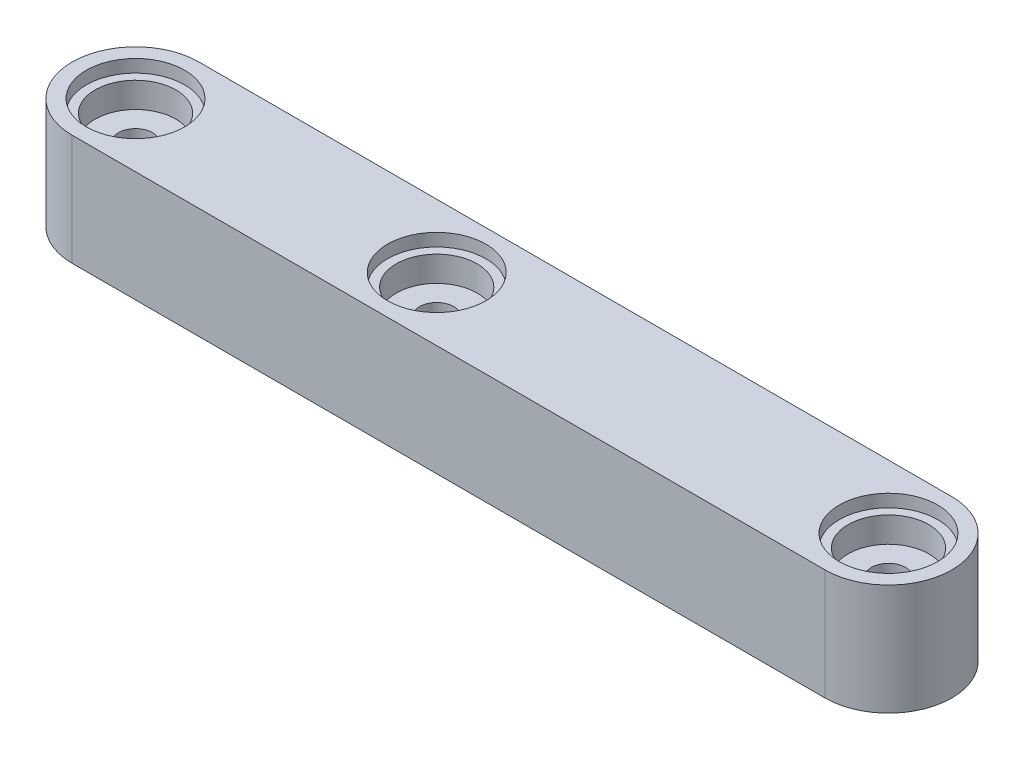
ISO-10303-21;
HEADER;
FILE_DESCRIPTION(('STEP AP214'),'2;1');
FILE_NAME('part.step','',(''),(''),'','','');
FILE_SCHEMA(('AUTOMOTIVE_DESIGN { 1 0 10303 214 1 1 1 1 }'));
ENDSEC;
DATA;
#1=APPLICATION_CONTEXT('core data for automotive mechanical design processes');
#2=APPLICATION_PROTOCOL_DEFINITION('international standard','automotive_design',2000,#1);
#3=PRODUCT_CONTEXT('',#1,'mechanical');
#4=PRODUCT('Part','Part','',(#3));
#5=PRODUCT_RELATED_PRODUCT_CATEGORY('part','',(#4));
#6=PRODUCT_DEFINITION_FORMATION('','',#4);
#7=PRODUCT_DEFINITION_CONTEXT('part definition',#1,'design');
#8=PRODUCT_DEFINITION('design','',#6,#7);
#9=PRODUCT_DEFINITION_SHAPE('','',#8);
#10=(LENGTH_UNIT() NAMED_UNIT(*) SI_UNIT(.MILLI.,.METRE.));
#11=(NAMED_UNIT(*) PLANE_ANGLE_UNIT() SI_UNIT($,.RADIAN.));
#12=(NAMED_UNIT(*) SI_UNIT($,.STERADIAN.) SOLID_ANGLE_UNIT());
#13=UNCERTAINTY_MEASURE_WITH_UNIT(LENGTH_MEASURE(1.E-05),#10,'distance_accuracy_value','');
#14=(GEOMETRIC_REPRESENTATION_CONTEXT(3) GLOBAL_UNCERTAINTY_ASSIGNED_CONTEXT((#13)) GLOBAL_UNIT_ASSIGNED_CONTEXT((#10,
#11,#12)) REPRESENTATION_CONTEXT('',''));
#15=CARTESIAN_POINT('',(0.,0.,0.));
#16=DIRECTION('',(0.,0.,1.));
#17=DIRECTION('',(1.,0.,0.));
#18=AXIS2_PLACEMENT_3D('',#15,#16,#17);
#19=CARTESIAN_POINT('',(47.5,4.6,4.));
#20=DIRECTION('',(0.,1.,0.));
#21=DIRECTION('',(0.,0.,1.));
#22=AXIS2_PLACEMENT_3D('',#19,#20,#21);
#23=CYLINDRICAL_SURFACE('',#22,2.55);
#24=CARTESIAN_POINT('',(47.5,4.6,4.));
#25=DIRECTION('',(0.,1.,0.));
#26=DIRECTION('',(0.,0.,1.));
#27=AXIS2_PLACEMENT_3D('',#24,#25,#26);
#28=CIRCLE('',#27,2.55);
#29=CARTESIAN_POINT('',(47.5,4.6,6.55));
#30=VERTEX_POINT('',#29);
#31=EDGE_CURVE('E134',#30,#30,#28,.T.);
#32=ORIENTED_EDGE('',*,*,#31,.F.);
#33=EDGE_LOOP('',(#32));
#34=FACE_BOUND('',#33,.T.);
#35=CARTESIAN_POINT('',(47.5,6.2,4.));
#36=DIRECTION('',(0.,1.,0.));
#37=DIRECTION('',(0.,0.,1.));
#38=AXIS2_PLACEMENT_3D('',#35,#36,#37);
#39=CIRCLE('',#38,2.55);
#40=CARTESIAN_POINT('',(47.5,6.2,6.55));
#41=VERTEX_POINT('',#40);
#42=EDGE_CURVE('E39',#41,#41,#39,.F.);
#43=ORIENTED_EDGE('',*,*,#42,.F.);
#44=EDGE_LOOP('',(#43));
#45=FACE_BOUND('',#44,.T.);
#46=ADVANCED_FACE('F35',(#34,#45),#23,.F.);
#47=CARTESIAN_POINT('',(19.,4.6,4.));
#48=DIRECTION('',(0.,1.,0.));
#49=DIRECTION('',(0.,0.,1.));
#50=AXIS2_PLACEMENT_3D('',#47,#48,#49);
#51=CYLINDRICAL_SURFACE('',#50,2.55);
#52=CARTESIAN_POINT('',(19.,4.6,4.));
#53=DIRECTION('',(0.,1.,0.));
#54=DIRECTION('',(0.,0.,1.));
#55=AXIS2_PLACEMENT_3D('',#52,#53,#54);
#56=CIRCLE('',#55,2.55);
#57=CARTESIAN_POINT('',(19.,4.6,6.55));
#58=VERTEX_POINT('',#57);
#59=EDGE_CURVE('E130',#58,#58,#56,.T.);
#60=ORIENTED_EDGE('',*,*,#59,.F.);
#61=EDGE_LOOP('',(#60));
#62=FACE_BOUND('',#61,.T.);
#63=CARTESIAN_POINT('',(19.,6.2,4.));
#64=DIRECTION('',(0.,1.,0.));
#65=DIRECTION('',(0.,0.,1.));
#66=AXIS2_PLACEMENT_3D('',#63,#64,#65);
#67=CIRCLE('',#66,2.55);
#68=CARTESIAN_POINT('',(19.,6.2,6.55));
#69=VERTEX_POINT('',#68);
#70=EDGE_CURVE('E124',#69,#69,#67,.F.);
#71=ORIENTED_EDGE('',*,*,#70,.F.);
#72=EDGE_LOOP('',(#71));
#73=FACE_BOUND('',#72,.T.);
#74=ADVANCED_FACE('F219',(#62,#73),#51,.F.);
#75=CARTESIAN_POINT('',(0.,4.6,4.));
#76=DIRECTION('',(0.,1.,0.));
#77=DIRECTION('',(0.,0.,1.));
#78=AXIS2_PLACEMENT_3D('',#75,#76,#77);
#79=CYLINDRICAL_SURFACE('',#78,2.55);
#80=CARTESIAN_POINT('',(0.,4.6,4.));
#81=DIRECTION('',(0.,1.,0.));
#82=DIRECTION('',(0.,0.,1.));
#83=AXIS2_PLACEMENT_3D('',#80,#81,#82);
#84=CIRCLE('',#83,2.55);
#85=CARTESIAN_POINT('',(0.,4.6,6.55));
#86=VERTEX_POINT('',#85);
#87=EDGE_CURVE('E115',#86,#86,#84,.T.);
#88=ORIENTED_EDGE('',*,*,#87,.F.);
#89=EDGE_LOOP('',(#88));
#90=FACE_BOUND('',#89,.T.);
#91=CARTESIAN_POINT('',(0.,6.2,4.));
#92=DIRECTION('',(0.,1.,0.));
#93=DIRECTION('',(0.,0.,1.));
#94=AXIS2_PLACEMENT_3D('',#91,#92,#93);
#95=CIRCLE('',#94,2.55);
#96=CARTESIAN_POINT('',(0.,6.2,6.55));
#97=VERTEX_POINT('',#96);
#98=EDGE_CURVE('E122',#97,#97,#95,.F.);
#99=ORIENTED_EDGE('',*,*,#98,.F.);
#100=EDGE_LOOP('',(#99));
#101=FACE_BOUND('',#100,.T.);
#102=ADVANCED_FACE('F157',(#90,#101),#79,.F.);
#103=CARTESIAN_POINT('',(0.,7.,4.));
#104=DIRECTION('',(0.,-1.,0.));
#105=DIRECTION('',(0.,0.,-1.));
#106=AXIS2_PLACEMENT_3D('',#103,#104,#105);
#107=CYLINDRICAL_SURFACE('',#106,1.075);
#108=CARTESIAN_POINT('',(0.,0.,4.));
#109=DIRECTION('',(0.,1.,0.));
#110=DIRECTION('',(0.,0.,1.));
#111=AXIS2_PLACEMENT_3D('',#108,#109,#110);
#112=CIRCLE('',#111,1.075);
#113=CARTESIAN_POINT('',(0.,0.,5.075));
#114=VERTEX_POINT('',#113);
#115=EDGE_CURVE('E105',#114,#114,#112,.T.);
#116=ORIENTED_EDGE('',*,*,#115,.F.);
#117=EDGE_LOOP('',(#116));
#118=FACE_BOUND('',#117,.T.);
#119=CARTESIAN_POINT('',(0.,4.6,4.));
#120=DIRECTION('',(0.,1.,0.));
#121=DIRECTION('',(0.,0.,1.));
#122=AXIS2_PLACEMENT_3D('',#119,#120,#121);
#123=CIRCLE('',#122,1.075);
#124=CARTESIAN_POINT('',(0.,4.6,5.075));
#125=VERTEX_POINT('',#124);
#126=EDGE_CURVE('E118',#125,#125,#123,.T.);
#127=ORIENTED_EDGE('',*,*,#126,.T.);
#128=EDGE_LOOP('',(#127));
#129=FACE_BOUND('',#128,.T.);
#130=ADVANCED_FACE('F153',(#118,#129),#107,.F.);
#131=CARTESIAN_POINT('',(19.,7.,4.));
#132=DIRECTION('',(0.,-1.,0.));
#133=DIRECTION('',(0.,0.,-1.));
#134=AXIS2_PLACEMENT_3D('',#131,#132,#133);
#135=CYLINDRICAL_SURFACE('',#134,1.075);
#136=CARTESIAN_POINT('',(19.,0.,4.));
#137=DIRECTION('',(0.,1.,0.));
#138=DIRECTION('',(0.,0.,1.));
#139=AXIS2_PLACEMENT_3D('',#136,#137,#138);
#140=CIRCLE('',#139,1.075);
#141=CARTESIAN_POINT('',(19.,0.,5.075));
#142=VERTEX_POINT('',#141);
#143=EDGE_CURVE('E144',#142,#142,#140,.T.);
#144=ORIENTED_EDGE('',*,*,#143,.F.);
#145=EDGE_LOOP('',(#144));
#146=FACE_BOUND('',#145,.T.);
#147=CARTESIAN_POINT('',(19.,4.6,4.));
#148=DIRECTION('',(0.,1.,0.));
#149=DIRECTION('',(0.,0.,1.));
#150=AXIS2_PLACEMENT_3D('',#147,#148,#149);
#151=CIRCLE('',#150,1.075);
#152=CARTESIAN_POINT('',(19.,4.6,5.075));
#153=VERTEX_POINT('',#152);
#154=EDGE_CURVE('E114',#153,#153,#151,.T.);
#155=ORIENTED_EDGE('',*,*,#154,.T.);
#156=EDGE_LOOP('',(#155));
#157=FACE_BOUND('',#156,.T.);
#158=ADVANCED_FACE('F156',(#146,#157),#135,.F.);
#159=CARTESIAN_POINT('',(47.5,7.,4.));
#160=DIRECTION('',(0.,-1.,0.));
#161=DIRECTION('',(0.,0.,-1.));
#162=AXIS2_PLACEMENT_3D('',#159,#160,#161);
#163=CYLINDRICAL_SURFACE('',#162,1.075);
#164=CARTESIAN_POINT('',(47.5,0.,4.));
#165=DIRECTION('',(0.,1.,0.));
#166=DIRECTION('',(0.,0.,1.));
#167=AXIS2_PLACEMENT_3D('',#164,#165,#166);
#168=CIRCLE('',#167,1.075);
#169=CARTESIAN_POINT('',(47.5,0.,5.075));
#170=VERTEX_POINT('',#169);
#171=EDGE_CURVE('E121',#170,#170,#168,.T.);
#172=ORIENTED_EDGE('',*,*,#171,.F.);
#173=EDGE_LOOP('',(#172));
#174=FACE_BOUND('',#173,.T.);
#175=CARTESIAN_POINT('',(47.5,4.6,4.));
#176=DIRECTION('',(0.,1.,0.));
#177=DIRECTION('',(0.,0.,1.));
#178=AXIS2_PLACEMENT_3D('',#175,#176,#177);
#179=CIRCLE('',#178,1.075);
#180=CARTESIAN_POINT('',(47.5,4.6,5.075));
#181=VERTEX_POINT('',#180);
#182=EDGE_CURVE('E111',#181,#181,#179,.T.);
#183=ORIENTED_EDGE('',*,*,#182,.T.);
#184=EDGE_LOOP('',(#183));
#185=FACE_BOUND('',#184,.T.);
#186=ADVANCED_FACE('F200',(#174,#185),#163,.F.);
#187=CARTESIAN_POINT('',(0.,7.,4.));
#188=DIRECTION('',(0.,1.,0.));
#189=DIRECTION('',(0.,0.,1.));
#190=AXIS2_PLACEMENT_3D('',#187,#188,#189);
#191=PLANE('',#190);
#192=CARTESIAN_POINT('',(0.,7.,4.));
#193=DIRECTION('',(0.,1.,0.));
#194=DIRECTION('',(0.,0.,1.));
#195=AXIS2_PLACEMENT_3D('',#192,#193,#194);
#196=CIRCLE('',#195,3.1);
#197=CARTESIAN_POINT('',(0.,7.,7.1));
#198=VERTEX_POINT('',#197);
#199=EDGE_CURVE('E183',#198,#198,#196,.T.);
#200=ORIENTED_EDGE('',*,*,#199,.F.);
#201=EDGE_LOOP('',(#200));
#202=FACE_BOUND('',#201,.T.);
#203=CARTESIAN_POINT('',(19.,7.,4.));
#204=DIRECTION('',(0.,1.,0.));
#205=DIRECTION('',(0.,0.,1.));
#206=AXIS2_PLACEMENT_3D('',#203,#204,#205);
#207=CIRCLE('',#206,3.1);
#208=CARTESIAN_POINT('',(19.,7.,7.1));
#209=VERTEX_POINT('',#208);
#210=EDGE_CURVE('E177',#209,#209,#207,.T.);
#211=ORIENTED_EDGE('',*,*,#210,.F.);
#212=EDGE_LOOP('',(#211));
#213=FACE_BOUND('',#212,.T.);
#214=CARTESIAN_POINT('',(47.5,7.,4.));
#215=DIRECTION('',(0.,1.,0.));
#216=DIRECTION('',(0.,0.,1.));
#217=AXIS2_PLACEMENT_3D('',#214,#215,#216);
#218=CIRCLE('',#217,3.1);
#219=CARTESIAN_POINT('',(47.5,7.,7.1));
#220=VERTEX_POINT('',#219);
#221=EDGE_CURVE('E171',#220,#220,#218,.T.);
#222=ORIENTED_EDGE('',*,*,#221,.F.);
#223=EDGE_LOOP('',(#222));
#224=FACE_BOUND('',#223,.T.);
#225=CARTESIAN_POINT('',(0.,7.,4.));
#226=DIRECTION('',(0.,1.,0.));
#227=DIRECTION('',(0.,0.,1.));
#228=AXIS2_PLACEMENT_3D('',#225,#226,#227);
#229=CIRCLE('',#228,4.);
#230=CARTESIAN_POINT('',(0.,7.,0.));
#231=VERTEX_POINT('',#230);
#232=CARTESIAN_POINT('',(0.,7.,8.));
#233=VERTEX_POINT('',#232);
#234=EDGE_CURVE('E89',#231,#233,#229,.T.);
#235=ORIENTED_EDGE('',*,*,#234,.T.);
#236=DIRECTION('',(1.,0.,0.));
#237=VECTOR('',#236,1.);
#238=CARTESIAN_POINT('',(0.,7.,8.));
#239=LINE('',#238,#237);
#240=CARTESIAN_POINT('',(47.5,7.,8.));
#241=VERTEX_POINT('',#240);
#242=EDGE_CURVE('E84',#233,#241,#239,.T.);
#243=ORIENTED_EDGE('',*,*,#242,.T.);
#244=CARTESIAN_POINT('',(47.5,7.,4.));
#245=DIRECTION('',(0.,1.,0.));
#246=DIRECTION('',(0.,0.,1.));
#247=AXIS2_PLACEMENT_3D('',#244,#245,#246);
#248=CIRCLE('',#247,4.);
#249=CARTESIAN_POINT('',(47.5,7.,0.));
#250=VERTEX_POINT('',#249);
#251=EDGE_CURVE('E87',#241,#250,#248,.T.);
#252=ORIENTED_EDGE('',*,*,#251,.T.);
#253=DIRECTION('',(-1.,0.,0.));
#254=VECTOR('',#253,1.);
#255=CARTESIAN_POINT('',(0.,7.,0.));
#256=LINE('',#255,#254);
#257=EDGE_CURVE('E54',#250,#231,#256,.T.);
#258=ORIENTED_EDGE('',*,*,#257,.T.);
#259=EDGE_LOOP('',(#235,#243,#252,#258));
#260=FACE_BOUND('',#259,.T.);
#261=ADVANCED_FACE('F85',(#202,#213,#224,#260),#191,.T.);
#262=CARTESIAN_POINT('',(0.,0.,4.));
#263=DIRECTION('',(0.,1.,0.));
#264=DIRECTION('',(0.,0.,1.));
#265=AXIS2_PLACEMENT_3D('',#262,#263,#264);
#266=PLANE('',#265);
#267=CARTESIAN_POINT('',(0.,0.,4.));
#268=DIRECTION('',(0.,1.,0.));
#269=DIRECTION('',(0.,0.,1.));
#270=AXIS2_PLACEMENT_3D('',#267,#268,#269);
#271=CIRCLE('',#270,4.);
#272=CARTESIAN_POINT('',(0.,0.,0.));
#273=VERTEX_POINT('',#272);
#274=CARTESIAN_POINT('',(0.,0.,8.));
#275=VERTEX_POINT('',#274);
#276=EDGE_CURVE('E102',#273,#275,#271,.T.);
#277=ORIENTED_EDGE('',*,*,#276,.F.);
#278=DIRECTION('',(-1.,0.,0.));
#279=VECTOR('',#278,1.);
#280=CARTESIAN_POINT('',(0.,0.,0.));
#281=LINE('',#280,#279);
#282=CARTESIAN_POINT('',(47.5,0.,0.));
#283=VERTEX_POINT('',#282);
#284=EDGE_CURVE('E77',#283,#273,#281,.T.);
#285=ORIENTED_EDGE('',*,*,#284,.F.);
#286=CARTESIAN_POINT('',(47.5,0.,4.));
#287=DIRECTION('',(0.,1.,0.));
#288=DIRECTION('',(0.,0.,1.));
#289=AXIS2_PLACEMENT_3D('',#286,#287,#288);
#290=CIRCLE('',#289,4.);
#291=CARTESIAN_POINT('',(47.5,0.,8.));
#292=VERTEX_POINT('',#291);
#293=EDGE_CURVE('E71',#292,#283,#290,.T.);
#294=ORIENTED_EDGE('',*,*,#293,.F.);
#295=DIRECTION('',(1.,0.,0.));
#296=VECTOR('',#295,1.);
#297=CARTESIAN_POINT('',(0.,0.,8.));
#298=LINE('',#297,#296);
#299=EDGE_CURVE('E93',#275,#292,#298,.T.);
#300=ORIENTED_EDGE('',*,*,#299,.F.);
#301=EDGE_LOOP('',(#277,#285,#294,#300));
#302=FACE_BOUND('',#301,.T.);
#303=ORIENTED_EDGE('',*,*,#115,.T.);
#304=EDGE_LOOP('',(#303));
#305=FACE_BOUND('',#304,.T.);
#306=ORIENTED_EDGE('',*,*,#143,.T.);
#307=EDGE_LOOP('',(#306));
#308=FACE_BOUND('',#307,.T.);
#309=ORIENTED_EDGE('',*,*,#171,.T.);
#310=EDGE_LOOP('',(#309));
#311=FACE_BOUND('',#310,.T.);
#312=ADVANCED_FACE('F150',(#302,#305,#308,#311),#266,.F.);
#313=CARTESIAN_POINT('',(0.,7.,4.));
#314=DIRECTION('',(0.,-1.,0.));
#315=DIRECTION('',(0.,0.,-1.));
#316=AXIS2_PLACEMENT_3D('',#313,#314,#315);
#317=CYLINDRICAL_SURFACE('',#316,4.);
#318=ORIENTED_EDGE('',*,*,#276,.T.);
#319=DIRECTION('',(0.,-1.,0.));
#320=VECTOR('',#319,1.);
#321=CARTESIAN_POINT('',(0.,7.,8.));
#322=LINE('',#321,#320);
#323=EDGE_CURVE('E11',#233,#275,#322,.T.);
#324=ORIENTED_EDGE('',*,*,#323,.F.);
#325=ORIENTED_EDGE('',*,*,#234,.F.);
#326=DIRECTION('',(0.,-1.,0.));
#327=VECTOR('',#326,1.);
#328=CARTESIAN_POINT('',(0.,7.,0.));
#329=LINE('',#328,#327);
#330=EDGE_CURVE('E98',#231,#273,#329,.T.);
#331=ORIENTED_EDGE('',*,*,#330,.T.);
#332=EDGE_LOOP('',(#318,#324,#325,#331));
#333=FACE_BOUND('',#332,.T.);
#334=ADVANCED_FACE('F37',(#333),#317,.T.);
#335=CARTESIAN_POINT('',(0.,7.,8.));
#336=DIRECTION('',(0.,0.,-1.));
#337=DIRECTION('',(-1.,0.,0.));
#338=AXIS2_PLACEMENT_3D('',#335,#336,#337);
#339=PLANE('',#338);
#340=ORIENTED_EDGE('',*,*,#299,.T.);
#341=DIRECTION('',(0.,-1.,0.));
#342=VECTOR('',#341,1.);
#343=CARTESIAN_POINT('',(47.5,7.,8.));
#344=LINE('',#343,#342);
#345=EDGE_CURVE('E45',#241,#292,#344,.T.);
#346=ORIENTED_EDGE('',*,*,#345,.F.);
#347=ORIENTED_EDGE('',*,*,#242,.F.);
#348=ORIENTED_EDGE('',*,*,#323,.T.);
#349=EDGE_LOOP('',(#340,#346,#347,#348));
#350=FACE_BOUND('',#349,.T.);
#351=ADVANCED_FACE('F92',(#350),#339,.F.);
#352=CARTESIAN_POINT('',(47.5,7.,4.));
#353=DIRECTION('',(0.,-1.,0.));
#354=DIRECTION('',(0.,0.,-1.));
#355=AXIS2_PLACEMENT_3D('',#352,#353,#354);
#356=CYLINDRICAL_SURFACE('',#355,4.);
#357=ORIENTED_EDGE('',*,*,#293,.T.);
#358=DIRECTION('',(0.,-1.,0.));
#359=VECTOR('',#358,1.);
#360=CARTESIAN_POINT('',(47.5,7.,0.));
#361=LINE('',#360,#359);
#362=EDGE_CURVE('E94',#250,#283,#361,.T.);
#363=ORIENTED_EDGE('',*,*,#362,.F.);
#364=ORIENTED_EDGE('',*,*,#251,.F.);
#365=ORIENTED_EDGE('',*,*,#345,.T.);
#366=EDGE_LOOP('',(#357,#363,#364,#365));
#367=FACE_BOUND('',#366,.T.);
#368=ADVANCED_FACE('F96',(#367),#356,.T.);
#369=CARTESIAN_POINT('',(0.,7.,0.));
#370=DIRECTION('',(0.,0.,1.));
#371=DIRECTION('',(1.,0.,0.));
#372=AXIS2_PLACEMENT_3D('',#369,#370,#371);
#373=PLANE('',#372);
#374=ORIENTED_EDGE('',*,*,#284,.T.);
#375=ORIENTED_EDGE('',*,*,#330,.F.);
#376=ORIENTED_EDGE('',*,*,#257,.F.);
#377=ORIENTED_EDGE('',*,*,#362,.T.);
#378=EDGE_LOOP('',(#374,#375,#376,#377));
#379=FACE_BOUND('',#378,.T.);
#380=ADVANCED_FACE('F245',(#379),#373,.F.);
#381=CARTESIAN_POINT('',(47.5,4.6,4.));
#382=DIRECTION('',(0.,1.,0.));
#383=DIRECTION('',(0.,0.,1.));
#384=AXIS2_PLACEMENT_3D('',#381,#382,#383);
#385=PLANE('',#384);
#386=ORIENTED_EDGE('',*,*,#182,.F.);
#387=EDGE_LOOP('',(#386));
#388=FACE_BOUND('',#387,.T.);
#389=ORIENTED_EDGE('',*,*,#31,.T.);
#390=EDGE_LOOP('',(#389));
#391=FACE_BOUND('',#390,.T.);
#392=ADVANCED_FACE('F231',(#388,#391),#385,.T.);
#393=CARTESIAN_POINT('',(19.,4.6,4.));
#394=DIRECTION('',(0.,1.,0.));
#395=DIRECTION('',(0.,0.,1.));
#396=AXIS2_PLACEMENT_3D('',#393,#394,#395);
#397=PLANE('',#396);
#398=ORIENTED_EDGE('',*,*,#154,.F.);
#399=EDGE_LOOP('',(#398));
#400=FACE_BOUND('',#399,.T.);
#401=ORIENTED_EDGE('',*,*,#59,.T.);
#402=EDGE_LOOP('',(#401));
#403=FACE_BOUND('',#402,.T.);
#404=ADVANCED_FACE('F165',(#400,#403),#397,.T.);
#405=CARTESIAN_POINT('',(0.,4.6,4.));
#406=DIRECTION('',(0.,1.,0.));
#407=DIRECTION('',(0.,0.,1.));
#408=AXIS2_PLACEMENT_3D('',#405,#406,#407);
#409=PLANE('',#408);
#410=ORIENTED_EDGE('',*,*,#126,.F.);
#411=EDGE_LOOP('',(#410));
#412=FACE_BOUND('',#411,.T.);
#413=ORIENTED_EDGE('',*,*,#87,.T.);
#414=EDGE_LOOP('',(#413));
#415=FACE_BOUND('',#414,.T.);
#416=ADVANCED_FACE('F161',(#412,#415),#409,.T.);
#417=CARTESIAN_POINT('',(0.,6.2,4.));
#418=DIRECTION('',(0.,1.,0.));
#419=DIRECTION('',(0.,0.,1.));
#420=AXIS2_PLACEMENT_3D('',#417,#418,#419);
#421=PLANE('',#420);
#422=CARTESIAN_POINT('',(0.,6.2,4.));
#423=DIRECTION('',(0.,1.,0.));
#424=DIRECTION('',(0.,0.,1.));
#425=AXIS2_PLACEMENT_3D('',#422,#423,#424);
#426=CIRCLE('',#425,3.1);
#427=CARTESIAN_POINT('',(0.,6.2,7.1));
#428=VERTEX_POINT('',#427);
#429=EDGE_CURVE('E125',#428,#428,#426,.T.);
#430=ORIENTED_EDGE('',*,*,#429,.T.);
#431=EDGE_LOOP('',(#430));
#432=FACE_BOUND('',#431,.T.);
#433=ORIENTED_EDGE('',*,*,#98,.T.);
#434=EDGE_LOOP('',(#433));
#435=FACE_BOUND('',#434,.T.);
#436=ADVANCED_FACE('F164',(#432,#435),#421,.T.);
#437=CARTESIAN_POINT('',(0.,6.2,4.));
#438=DIRECTION('',(0.,1.,0.));
#439=DIRECTION('',(0.,0.,1.));
#440=AXIS2_PLACEMENT_3D('',#437,#438,#439);
#441=CYLINDRICAL_SURFACE('',#440,3.1);
#442=ORIENTED_EDGE('',*,*,#429,.F.);
#443=EDGE_LOOP('',(#442));
#444=FACE_BOUND('',#443,.T.);
#445=ORIENTED_EDGE('',*,*,#199,.T.);
#446=EDGE_LOOP('',(#445));
#447=FACE_BOUND('',#446,.T.);
#448=ADVANCED_FACE('F191',(#444,#447),#441,.F.);
#449=CARTESIAN_POINT('',(19.,6.2,4.));
#450=DIRECTION('',(0.,1.,0.));
#451=DIRECTION('',(0.,0.,1.));
#452=AXIS2_PLACEMENT_3D('',#449,#450,#451);
#453=PLANE('',#452);
#454=CARTESIAN_POINT('',(19.,6.2,4.));
#455=DIRECTION('',(0.,1.,0.));
#456=DIRECTION('',(0.,0.,1.));
#457=AXIS2_PLACEMENT_3D('',#454,#455,#456);
#458=CIRCLE('',#457,3.1);
#459=CARTESIAN_POINT('',(19.,6.2,7.1));
#460=VERTEX_POINT('',#459);
#461=EDGE_CURVE('E180',#460,#460,#458,.T.);
#462=ORIENTED_EDGE('',*,*,#461,.T.);
#463=EDGE_LOOP('',(#462));
#464=FACE_BOUND('',#463,.T.);
#465=ORIENTED_EDGE('',*,*,#70,.T.);
#466=EDGE_LOOP('',(#465));
#467=FACE_BOUND('',#466,.T.);
#468=ADVANCED_FACE('F194',(#464,#467),#453,.T.);
#469=CARTESIAN_POINT('',(19.,6.2,4.));
#470=DIRECTION('',(0.,1.,0.));
#471=DIRECTION('',(0.,0.,1.));
#472=AXIS2_PLACEMENT_3D('',#469,#470,#471);
#473=CYLINDRICAL_SURFACE('',#472,3.1);
#474=ORIENTED_EDGE('',*,*,#461,.F.);
#475=EDGE_LOOP('',(#474));
#476=FACE_BOUND('',#475,.T.);
#477=ORIENTED_EDGE('',*,*,#210,.T.);
#478=EDGE_LOOP('',(#477));
#479=FACE_BOUND('',#478,.T.);
#480=ADVANCED_FACE('F214',(#476,#479),#473,.F.);
#481=CARTESIAN_POINT('',(47.5,6.2,4.));
#482=DIRECTION('',(0.,1.,0.));
#483=DIRECTION('',(0.,0.,1.));
#484=AXIS2_PLACEMENT_3D('',#481,#482,#483);
#485=PLANE('',#484);
#486=CARTESIAN_POINT('',(47.5,6.2,4.));
#487=DIRECTION('',(0.,1.,0.));
#488=DIRECTION('',(0.,0.,1.));
#489=AXIS2_PLACEMENT_3D('',#486,#487,#488);
#490=CIRCLE('',#489,3.1);
#491=CARTESIAN_POINT('',(47.5,6.2,7.1));
#492=VERTEX_POINT('',#491);
#493=EDGE_CURVE('E174',#492,#492,#490,.T.);
#494=ORIENTED_EDGE('',*,*,#493,.T.);
#495=EDGE_LOOP('',(#494));
#496=FACE_BOUND('',#495,.T.);
#497=ORIENTED_EDGE('',*,*,#42,.T.);
#498=EDGE_LOOP('',(#497));
#499=FACE_BOUND('',#498,.T.);
#500=ADVANCED_FACE('F208',(#496,#499),#485,.T.);
#501=CARTESIAN_POINT('',(47.5,6.2,4.));
#502=DIRECTION('',(0.,1.,0.));
#503=DIRECTION('',(0.,0.,1.));
#504=AXIS2_PLACEMENT_3D('',#501,#502,#503);
#505=CYLINDRICAL_SURFACE('',#504,3.1);
#506=ORIENTED_EDGE('',*,*,#493,.F.);
#507=EDGE_LOOP('',(#506));
#508=FACE_BOUND('',#507,.T.);
#509=ORIENTED_EDGE('',*,*,#221,.T.);
#510=EDGE_LOOP('',(#509));
#511=FACE_BOUND('',#510,.T.);
#512=ADVANCED_FACE('F206',(#508,#511),#505,.F.);
#513=CLOSED_SHELL('',(#46,#74,#102,#130,#158,#186,#261,#312,#334,#351,#368,#380,#392,#404,#416,
#436,#448,#468,#480,#500,#512));
#514=MANIFOLD_SOLID_BREP('B2',#513);
#515=ADVANCED_BREP_SHAPE_REPRESENTATION('',(#18,#514),#14);
#516=SHAPE_DEFINITION_REPRESENTATION(#9,#515);
ENDSEC;
END-ISO-10303-21;
